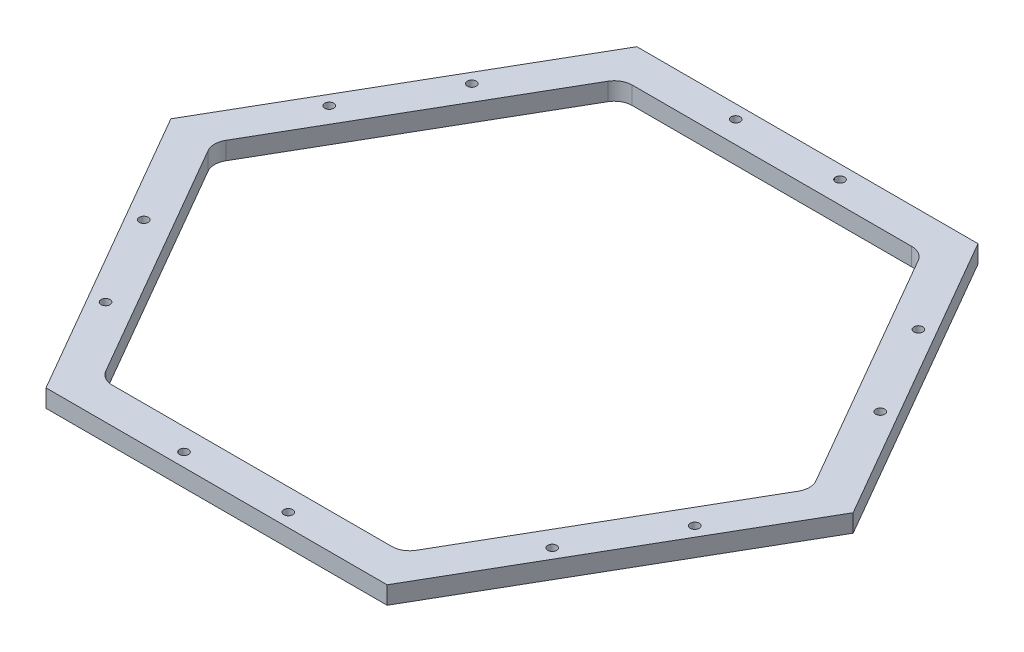
ISO-10303-21;
HEADER;
FILE_DESCRIPTION(('STEP AP214'),'2;1');
FILE_NAME('part.step','',(''),(''),'','','');
FILE_SCHEMA(('AUTOMOTIVE_DESIGN { 1 0 10303 214 1 1 1 1 }'));
ENDSEC;
DATA;
#1=APPLICATION_CONTEXT('core data for automotive mechanical design processes');
#2=APPLICATION_PROTOCOL_DEFINITION('international standard','automotive_design',2000,#1);
#3=PRODUCT_CONTEXT('',#1,'mechanical');
#4=PRODUCT('Part','Part','',(#3));
#5=PRODUCT_RELATED_PRODUCT_CATEGORY('part','',(#4));
#6=PRODUCT_DEFINITION_FORMATION('','',#4);
#7=PRODUCT_DEFINITION_CONTEXT('part definition',#1,'design');
#8=PRODUCT_DEFINITION('design','',#6,#7);
#9=PRODUCT_DEFINITION_SHAPE('','',#8);
#10=(LENGTH_UNIT() NAMED_UNIT(*) SI_UNIT(.MILLI.,.METRE.));
#11=(NAMED_UNIT(*) PLANE_ANGLE_UNIT() SI_UNIT($,.RADIAN.));
#12=(NAMED_UNIT(*) SI_UNIT($,.STERADIAN.) SOLID_ANGLE_UNIT());
#13=UNCERTAINTY_MEASURE_WITH_UNIT(LENGTH_MEASURE(1.E-05),#10,'distance_accuracy_value','');
#14=(GEOMETRIC_REPRESENTATION_CONTEXT(3) GLOBAL_UNCERTAINTY_ASSIGNED_CONTEXT((#13)) GLOBAL_UNIT_ASSIGNED_CONTEXT((#10,
#11,#12)) REPRESENTATION_CONTEXT('',''));
#15=CARTESIAN_POINT('',(0.,0.,0.));
#16=DIRECTION('',(0.,0.,1.));
#17=DIRECTION('',(1.,0.,0.));
#18=AXIS2_PLACEMENT_3D('',#15,#16,#17);
#19=CARTESIAN_POINT('',(0.,3.175,0.));
#20=DIRECTION('',(0.,1.,0.));
#21=DIRECTION('',(0.,0.,1.));
#22=AXIS2_PLACEMENT_3D('',#19,#20,#21);
#23=PLANE('',#22);
#24=CARTESIAN_POINT('',(47.7785158759953,3.175,-18.0656528205675));
#25=DIRECTION('',(0.,1.,0.));
#26=DIRECTION('',(0.,0.,1.));
#27=AXIS2_PLACEMENT_3D('',#24,#25,#26);
#28=CIRCLE('',#27,0.799999999999988);
#29=CARTESIAN_POINT('',(47.7785158759953,3.175,-17.2656528205675));
#30=VERTEX_POINT('',#29);
#31=EDGE_CURVE('E348',#30,#30,#28,.T.);
#32=ORIENTED_EDGE('',*,*,#31,.F.);
#33=EDGE_LOOP('',(#32));
#34=FACE_BOUND('',#33,.T.);
#35=CARTESIAN_POINT('',(38.4471631671902,3.175,-34.2280298155628));
#36=DIRECTION('',(0.,1.,0.));
#37=DIRECTION('',(0.,0.,1.));
#38=AXIS2_PLACEMENT_3D('',#35,#36,#37);
#39=CIRCLE('',#38,0.799999999999988);
#40=CARTESIAN_POINT('',(38.4471631671902,3.175,-33.4280298155628));
#41=VERTEX_POINT('',#40);
#42=EDGE_CURVE('E338',#41,#41,#39,.T.);
#43=ORIENTED_EDGE('',*,*,#42,.F.);
#44=EDGE_LOOP('',(#43));
#45=FACE_BOUND('',#44,.T.);
#46=CARTESIAN_POINT('',(39.534572216559,3.175,32.3445820934464));
#47=DIRECTION('',(0.,1.,0.));
#48=DIRECTION('',(0.,0.,1.));
#49=AXIS2_PLACEMENT_3D('',#46,#47,#48);
#50=CIRCLE('',#49,0.799999999999988);
#51=CARTESIAN_POINT('',(39.534572216559,3.175,33.1445820934464));
#52=VERTEX_POINT('',#51);
#53=EDGE_CURVE('E335',#52,#52,#50,.T.);
#54=ORIENTED_EDGE('',*,*,#53,.F.);
#55=EDGE_LOOP('',(#54));
#56=FACE_BOUND('',#55,.T.);
#57=CARTESIAN_POINT('',(48.8659249253636,3.175,16.1822050984508));
#58=DIRECTION('',(0.,1.,0.));
#59=DIRECTION('',(0.,0.,1.));
#60=AXIS2_PLACEMENT_3D('',#57,#58,#59);
#61=CIRCLE('',#60,0.799999999999988);
#62=CARTESIAN_POINT('',(48.8659249253636,3.175,16.9822050984508));
#63=VERTEX_POINT('',#62);
#64=EDGE_CURVE('E332',#63,#63,#61,.T.);
#65=ORIENTED_EDGE('',*,*,#64,.F.);
#66=EDGE_LOOP('',(#65));
#67=FACE_BOUND('',#66,.T.);
#68=CARTESIAN_POINT('',(-8.24394365943684,3.175,50.4102349140137));
#69=DIRECTION('',(0.,1.,0.));
#70=DIRECTION('',(0.,0.,1.));
#71=AXIS2_PLACEMENT_3D('',#68,#69,#70);
#72=CIRCLE('',#71,0.79999999999999);
#73=CARTESIAN_POINT('',(-8.24394365943684,3.175,51.2102349140137));
#74=VERTEX_POINT('',#73);
#75=EDGE_CURVE('E328',#74,#74,#72,.T.);
#76=ORIENTED_EDGE('',*,*,#75,.F.);
#77=EDGE_LOOP('',(#76));
#78=FACE_BOUND('',#77,.T.);
#79=CARTESIAN_POINT('',(10.4187617581729,3.175,50.4102349140136));
#80=DIRECTION('',(0.,1.,0.));
#81=DIRECTION('',(0.,0.,1.));
#82=AXIS2_PLACEMENT_3D('',#79,#80,#81);
#83=CIRCLE('',#82,0.79999999999999);
#84=CARTESIAN_POINT('',(10.4187617581729,3.175,51.2102349140136));
#85=VERTEX_POINT('',#84);
#86=EDGE_CURVE('E324',#85,#85,#83,.T.);
#87=ORIENTED_EDGE('',*,*,#86,.F.);
#88=EDGE_LOOP('',(#87));
#89=FACE_BOUND('',#88,.T.);
#90=CARTESIAN_POINT('',(-47.7785158759955,3.175,18.0656528205671));
#91=DIRECTION('',(0.,1.,0.));
#92=DIRECTION('',(0.,0.,1.));
#93=AXIS2_PLACEMENT_3D('',#90,#91,#92);
#94=CIRCLE('',#93,0.799999999999988);
#95=CARTESIAN_POINT('',(-47.7785158759955,3.175,18.8656528205671));
#96=VERTEX_POINT('',#95);
#97=EDGE_CURVE('E320',#96,#96,#94,.T.);
#98=ORIENTED_EDGE('',*,*,#97,.F.);
#99=EDGE_LOOP('',(#98));
#100=FACE_BOUND('',#99,.T.);
#101=CARTESIAN_POINT('',(-38.4471631671904,3.175,34.2280298155625));
#102=DIRECTION('',(0.,1.,0.));
#103=DIRECTION('',(0.,0.,1.));
#104=AXIS2_PLACEMENT_3D('',#101,#102,#103);
#105=CIRCLE('',#104,0.799999999999988);
#106=CARTESIAN_POINT('',(-38.4471631671904,3.175,35.0280298155625));
#107=VERTEX_POINT('',#106);
#108=EDGE_CURVE('E316',#107,#107,#105,.T.);
#109=ORIENTED_EDGE('',*,*,#108,.F.);
#110=EDGE_LOOP('',(#109));
#111=FACE_BOUND('',#110,.T.);
#112=CARTESIAN_POINT('',(-39.5345722165588,3.175,-32.3445820934467));
#113=DIRECTION('',(0.,1.,0.));
#114=DIRECTION('',(0.,0.,1.));
#115=AXIS2_PLACEMENT_3D('',#112,#113,#114);
#116=CIRCLE('',#115,0.799999999999988);
#117=CARTESIAN_POINT('',(-39.5345722165588,3.175,-31.5445820934467));
#118=VERTEX_POINT('',#117);
#119=EDGE_CURVE('E312',#118,#118,#116,.T.);
#120=ORIENTED_EDGE('',*,*,#119,.F.);
#121=EDGE_LOOP('',(#120));
#122=FACE_BOUND('',#121,.T.);
#123=CARTESIAN_POINT('',(-48.8659249253635,3.175,-16.1822050984511));
#124=DIRECTION('',(0.,1.,0.));
#125=DIRECTION('',(0.,0.,1.));
#126=AXIS2_PLACEMENT_3D('',#123,#124,#125);
#127=CIRCLE('',#126,0.799999999999988);
#128=CARTESIAN_POINT('',(-48.8659249253635,3.175,-15.3822050984511));
#129=VERTEX_POINT('',#128);
#130=EDGE_CURVE('E308',#129,#129,#127,.T.);
#131=ORIENTED_EDGE('',*,*,#130,.F.);
#132=EDGE_LOOP('',(#131));
#133=FACE_BOUND('',#132,.T.);
#134=CARTESIAN_POINT('',(8.24394365943684,3.175,-50.4102349140137));
#135=DIRECTION('',(0.,1.,0.));
#136=DIRECTION('',(0.,0.,1.));
#137=AXIS2_PLACEMENT_3D('',#134,#135,#136);
#138=CIRCLE('',#137,0.79999999999999);
#139=CARTESIAN_POINT('',(8.24394365943684,3.175,-49.6102349140137));
#140=VERTEX_POINT('',#139);
#141=EDGE_CURVE('E304',#140,#140,#138,.T.);
#142=ORIENTED_EDGE('',*,*,#141,.F.);
#143=EDGE_LOOP('',(#142));
#144=FACE_BOUND('',#143,.T.);
#145=CARTESIAN_POINT('',(-10.4187617581729,3.175,-50.4102349140136));
#146=DIRECTION('',(0.,1.,0.));
#147=DIRECTION('',(0.,0.,1.));
#148=AXIS2_PLACEMENT_3D('',#145,#146,#147);
#149=CIRCLE('',#148,0.79999999999999);
#150=CARTESIAN_POINT('',(-10.4187617581729,3.175,-49.6102349140136));
#151=VERTEX_POINT('',#150);
#152=EDGE_CURVE('E300',#151,#151,#149,.T.);
#153=ORIENTED_EDGE('',*,*,#152,.F.);
#154=EDGE_LOOP('',(#153));
#155=FACE_BOUND('',#154,.T.);
#156=DIRECTION('',(0.5,0.,-0.866025403784438));
#157=VECTOR('',#156,1.);
#158=CARTESIAN_POINT('',(30.4992613140312,3.175,52.8262701892219));
#159=LINE('',#158,#157);
#160=CARTESIAN_POINT('',(30.4992613140312,3.175,52.8262701892219));
#161=VERTEX_POINT('',#160);
#162=CARTESIAN_POINT('',(60.9985226280624,3.175,0.));
#163=VERTEX_POINT('',#162);
#164=EDGE_CURVE('E259',#161,#163,#159,.T.);
#165=ORIENTED_EDGE('',*,*,#164,.T.);
#166=DIRECTION('',(-0.5,0.,-0.866025403784439));
#167=VECTOR('',#166,1.);
#168=CARTESIAN_POINT('',(60.9985226280624,3.175,0.));
#169=LINE('',#168,#167);
#170=CARTESIAN_POINT('',(30.4992613140312,3.175,-52.8262701892219));
#171=VERTEX_POINT('',#170);
#172=EDGE_CURVE('E262',#163,#171,#169,.T.);
#173=ORIENTED_EDGE('',*,*,#172,.T.);
#174=DIRECTION('',(-1.,0.,0.));
#175=VECTOR('',#174,1.);
#176=CARTESIAN_POINT('',(30.4992613140312,3.175,-52.8262701892219));
#177=LINE('',#176,#175);
#178=CARTESIAN_POINT('',(-30.4992613140312,3.175,-52.8262701892219));
#179=VERTEX_POINT('',#178);
#180=EDGE_CURVE('E265',#171,#179,#177,.T.);
#181=ORIENTED_EDGE('',*,*,#180,.T.);
#182=DIRECTION('',(-0.5,0.,0.866025403784439));
#183=VECTOR('',#182,1.);
#184=CARTESIAN_POINT('',(-30.4992613140312,3.175,-52.8262701892219));
#185=LINE('',#184,#183);
#186=CARTESIAN_POINT('',(-60.9985226280624,3.175,0.));
#187=VERTEX_POINT('',#186);
#188=EDGE_CURVE('E267',#179,#187,#185,.T.);
#189=ORIENTED_EDGE('',*,*,#188,.T.);
#190=DIRECTION('',(0.5,0.,0.866025403784438));
#191=VECTOR('',#190,1.);
#192=CARTESIAN_POINT('',(-60.9985226280624,3.175,0.));
#193=LINE('',#192,#191);
#194=CARTESIAN_POINT('',(-30.4992613140312,3.175,52.8262701892219));
#195=VERTEX_POINT('',#194);
#196=EDGE_CURVE('E269',#187,#195,#193,.T.);
#197=ORIENTED_EDGE('',*,*,#196,.T.);
#198=DIRECTION('',(1.,0.,0.));
#199=VECTOR('',#198,1.);
#200=CARTESIAN_POINT('',(-30.4992613140312,3.175,52.8262701892219));
#201=LINE('',#200,#199);
#202=EDGE_CURVE('E271',#195,#161,#201,.T.);
#203=ORIENTED_EDGE('',*,*,#202,.T.);
#204=EDGE_LOOP('',(#165,#173,#181,#189,#197,#203));
#205=FACE_BOUND('',#204,.T.);
#206=DIRECTION('',(0.5,0.,0.866025403784438));
#207=VECTOR('',#206,1.);
#208=CARTESIAN_POINT('',(-52.7496306570156,3.175,1.58750000000003));
#209=LINE('',#208,#207);
#210=CARTESIAN_POINT('',(-52.7496306570156,3.175,1.58750000000003));
#211=VERTEX_POINT('',#210);
#212=CARTESIAN_POINT('',(-27.7496306570156,3.175,44.8887701892219));
#213=VERTEX_POINT('',#212);
#214=EDGE_CURVE('E172',#211,#213,#209,.T.);
#215=ORIENTED_EDGE('',*,*,#214,.F.);
#216=CARTESIAN_POINT('',(-50.,3.175,0.));
#217=DIRECTION('',(0.,1.,0.));
#218=DIRECTION('',(0.,0.,1.));
#219=AXIS2_PLACEMENT_3D('',#216,#217,#218);
#220=CIRCLE('',#219,3.17500000000001);
#221=CARTESIAN_POINT('',(-52.7496306570156,3.175,-1.58749999999998));
#222=VERTEX_POINT('',#221);
#223=EDGE_CURVE('E164',#222,#211,#220,.T.);
#224=ORIENTED_EDGE('',*,*,#223,.F.);
#225=DIRECTION('',(-0.5,0.,0.866025403784439));
#226=VECTOR('',#225,1.);
#227=CARTESIAN_POINT('',(-27.7496306570156,3.175,-44.8887701892219));
#228=LINE('',#227,#226);
#229=CARTESIAN_POINT('',(-27.7496306570156,3.175,-44.8887701892219));
#230=VERTEX_POINT('',#229);
#231=EDGE_CURVE('E206',#230,#222,#228,.T.);
#232=ORIENTED_EDGE('',*,*,#231,.F.);
#233=CARTESIAN_POINT('',(-25.,3.175,-43.3012701892219));
#234=DIRECTION('',(0.,1.,0.));
#235=DIRECTION('',(0.,0.,1.));
#236=AXIS2_PLACEMENT_3D('',#233,#234,#235);
#237=CIRCLE('',#236,3.175);
#238=CARTESIAN_POINT('',(-25.,3.175,-46.4762701892219));
#239=VERTEX_POINT('',#238);
#240=EDGE_CURVE('E204',#239,#230,#237,.T.);
#241=ORIENTED_EDGE('',*,*,#240,.F.);
#242=DIRECTION('',(-1.,0.,0.));
#243=VECTOR('',#242,1.);
#244=CARTESIAN_POINT('',(25.,3.175,-46.4762701892219));
#245=LINE('',#244,#243);
#246=CARTESIAN_POINT('',(25.,3.175,-46.4762701892219));
#247=VERTEX_POINT('',#246);
#248=EDGE_CURVE('E202',#247,#239,#245,.T.);
#249=ORIENTED_EDGE('',*,*,#248,.F.);
#250=CARTESIAN_POINT('',(25.,3.175,-43.3012701892219));
#251=DIRECTION('',(0.,1.,0.));
#252=DIRECTION('',(0.,0.,1.));
#253=AXIS2_PLACEMENT_3D('',#250,#251,#252);
#254=CIRCLE('',#253,3.175);
#255=CARTESIAN_POINT('',(27.7496306570156,3.175,-44.8887701892219));
#256=VERTEX_POINT('',#255);
#257=EDGE_CURVE('E200',#256,#247,#254,.T.);
#258=ORIENTED_EDGE('',*,*,#257,.F.);
#259=DIRECTION('',(-0.5,0.,-0.866025403784439));
#260=VECTOR('',#259,1.);
#261=CARTESIAN_POINT('',(52.7496306570156,3.175,-1.58750000000003));
#262=LINE('',#261,#260);
#263=CARTESIAN_POINT('',(52.7496306570156,3.175,-1.58750000000003));
#264=VERTEX_POINT('',#263);
#265=EDGE_CURVE('E198',#264,#256,#262,.T.);
#266=ORIENTED_EDGE('',*,*,#265,.F.);
#267=CARTESIAN_POINT('',(50.,3.175,0.));
#268=DIRECTION('',(0.,1.,0.));
#269=DIRECTION('',(0.,0.,-1.));
#270=AXIS2_PLACEMENT_3D('',#267,#268,#269);
#271=CIRCLE('',#270,3.175);
#272=CARTESIAN_POINT('',(52.7496306570156,3.175,1.58749999999997));
#273=VERTEX_POINT('',#272);
#274=EDGE_CURVE('E196',#273,#264,#271,.T.);
#275=ORIENTED_EDGE('',*,*,#274,.F.);
#276=DIRECTION('',(0.5,0.,-0.866025403784439));
#277=VECTOR('',#276,1.);
#278=CARTESIAN_POINT('',(27.7496306570156,3.175,44.8887701892219));
#279=LINE('',#278,#277);
#280=CARTESIAN_POINT('',(27.7496306570156,3.175,44.8887701892219));
#281=VERTEX_POINT('',#280);
#282=EDGE_CURVE('E194',#281,#273,#279,.T.);
#283=ORIENTED_EDGE('',*,*,#282,.F.);
#284=CARTESIAN_POINT('',(25.,3.175,43.3012701892219));
#285=DIRECTION('',(0.,1.,0.));
#286=DIRECTION('',(0.,0.,1.));
#287=AXIS2_PLACEMENT_3D('',#284,#285,#286);
#288=CIRCLE('',#287,3.175);
#289=CARTESIAN_POINT('',(25.,3.175,46.4762701892219));
#290=VERTEX_POINT('',#289);
#291=EDGE_CURVE('E192',#290,#281,#288,.T.);
#292=ORIENTED_EDGE('',*,*,#291,.F.);
#293=DIRECTION('',(1.,0.,0.));
#294=VECTOR('',#293,1.);
#295=CARTESIAN_POINT('',(-25.,3.175,46.4762701892219));
#296=LINE('',#295,#294);
#297=CARTESIAN_POINT('',(-25.,3.175,46.4762701892219));
#298=VERTEX_POINT('',#297);
#299=EDGE_CURVE('E187',#298,#290,#296,.T.);
#300=ORIENTED_EDGE('',*,*,#299,.F.);
#301=CARTESIAN_POINT('',(-25.,3.175,43.3012701892219));
#302=DIRECTION('',(0.,1.,0.));
#303=DIRECTION('',(0.,0.,1.));
#304=AXIS2_PLACEMENT_3D('',#301,#302,#303);
#305=CIRCLE('',#304,3.175);
#306=EDGE_CURVE('E185',#213,#298,#305,.T.);
#307=ORIENTED_EDGE('',*,*,#306,.F.);
#308=EDGE_LOOP('',(#215,#224,#232,#241,#249,#258,#266,#275,#283,#292,#300,#307));
#309=FACE_BOUND('',#308,.T.);
#310=ADVANCED_FACE('F37',(#34,#45,#56,#67,#78,#89,#100,#111,#122,#133,#144,#155,#205,#309),#23,.T.);
#311=CARTESIAN_POINT('',(0.,0.,0.));
#312=DIRECTION('',(0.,1.,0.));
#313=DIRECTION('',(0.,0.,1.));
#314=AXIS2_PLACEMENT_3D('',#311,#312,#313);
#315=PLANE('',#314);
#316=CARTESIAN_POINT('',(47.7785158759953,0.,-18.0656528205675));
#317=DIRECTION('',(0.,1.,0.));
#318=DIRECTION('',(0.,0.,1.));
#319=AXIS2_PLACEMENT_3D('',#316,#317,#318);
#320=CIRCLE('',#319,0.799999999999988);
#321=CARTESIAN_POINT('',(47.7785158759953,0.,-17.2656528205675));
#322=VERTEX_POINT('',#321);
#323=EDGE_CURVE('E41',#322,#322,#320,.T.);
#324=ORIENTED_EDGE('',*,*,#323,.T.);
#325=EDGE_LOOP('',(#324));
#326=FACE_BOUND('',#325,.T.);
#327=CARTESIAN_POINT('',(38.4471631671902,0.,-34.2280298155628));
#328=DIRECTION('',(0.,1.,0.));
#329=DIRECTION('',(0.,0.,1.));
#330=AXIS2_PLACEMENT_3D('',#327,#328,#329);
#331=CIRCLE('',#330,0.799999999999988);
#332=CARTESIAN_POINT('',(38.4471631671902,0.,-33.4280298155628));
#333=VERTEX_POINT('',#332);
#334=EDGE_CURVE('E336',#333,#333,#331,.T.);
#335=ORIENTED_EDGE('',*,*,#334,.T.);
#336=EDGE_LOOP('',(#335));
#337=FACE_BOUND('',#336,.T.);
#338=CARTESIAN_POINT('',(39.534572216559,0.,32.3445820934464));
#339=DIRECTION('',(0.,1.,0.));
#340=DIRECTION('',(0.,0.,1.));
#341=AXIS2_PLACEMENT_3D('',#338,#339,#340);
#342=CIRCLE('',#341,0.799999999999988);
#343=CARTESIAN_POINT('',(39.534572216559,0.,33.1445820934464));
#344=VERTEX_POINT('',#343);
#345=EDGE_CURVE('E333',#344,#344,#342,.T.);
#346=ORIENTED_EDGE('',*,*,#345,.T.);
#347=EDGE_LOOP('',(#346));
#348=FACE_BOUND('',#347,.T.);
#349=CARTESIAN_POINT('',(48.8659249253636,0.,16.1822050984508));
#350=DIRECTION('',(0.,1.,0.));
#351=DIRECTION('',(0.,0.,1.));
#352=AXIS2_PLACEMENT_3D('',#349,#350,#351);
#353=CIRCLE('',#352,0.799999999999988);
#354=CARTESIAN_POINT('',(48.8659249253636,0.,16.9822050984508));
#355=VERTEX_POINT('',#354);
#356=EDGE_CURVE('E329',#355,#355,#353,.T.);
#357=ORIENTED_EDGE('',*,*,#356,.T.);
#358=EDGE_LOOP('',(#357));
#359=FACE_BOUND('',#358,.T.);
#360=CARTESIAN_POINT('',(-8.24394365943684,0.,50.4102349140137));
#361=DIRECTION('',(0.,1.,0.));
#362=DIRECTION('',(0.,0.,1.));
#363=AXIS2_PLACEMENT_3D('',#360,#361,#362);
#364=CIRCLE('',#363,0.799999999999989);
#365=CARTESIAN_POINT('',(-8.24394365943684,0.,51.2102349140137));
#366=VERTEX_POINT('',#365);
#367=EDGE_CURVE('E325',#366,#366,#364,.T.);
#368=ORIENTED_EDGE('',*,*,#367,.T.);
#369=EDGE_LOOP('',(#368));
#370=FACE_BOUND('',#369,.T.);
#371=CARTESIAN_POINT('',(10.4187617581729,0.,50.4102349140136));
#372=DIRECTION('',(0.,1.,0.));
#373=DIRECTION('',(0.,0.,1.));
#374=AXIS2_PLACEMENT_3D('',#371,#372,#373);
#375=CIRCLE('',#374,0.799999999999989);
#376=CARTESIAN_POINT('',(10.4187617581729,0.,51.2102349140136));
#377=VERTEX_POINT('',#376);
#378=EDGE_CURVE('E321',#377,#377,#375,.T.);
#379=ORIENTED_EDGE('',*,*,#378,.T.);
#380=EDGE_LOOP('',(#379));
#381=FACE_BOUND('',#380,.T.);
#382=CARTESIAN_POINT('',(-47.7785158759955,0.,18.0656528205671));
#383=DIRECTION('',(0.,1.,0.));
#384=DIRECTION('',(0.,0.,1.));
#385=AXIS2_PLACEMENT_3D('',#382,#383,#384);
#386=CIRCLE('',#385,0.799999999999988);
#387=CARTESIAN_POINT('',(-47.7785158759955,0.,18.8656528205671));
#388=VERTEX_POINT('',#387);
#389=EDGE_CURVE('E317',#388,#388,#386,.T.);
#390=ORIENTED_EDGE('',*,*,#389,.T.);
#391=EDGE_LOOP('',(#390));
#392=FACE_BOUND('',#391,.T.);
#393=CARTESIAN_POINT('',(-38.4471631671904,0.,34.2280298155625));
#394=DIRECTION('',(0.,1.,0.));
#395=DIRECTION('',(0.,0.,1.));
#396=AXIS2_PLACEMENT_3D('',#393,#394,#395);
#397=CIRCLE('',#396,0.799999999999988);
#398=CARTESIAN_POINT('',(-38.4471631671904,0.,35.0280298155625));
#399=VERTEX_POINT('',#398);
#400=EDGE_CURVE('E313',#399,#399,#397,.T.);
#401=ORIENTED_EDGE('',*,*,#400,.T.);
#402=EDGE_LOOP('',(#401));
#403=FACE_BOUND('',#402,.T.);
#404=CARTESIAN_POINT('',(-39.5345722165588,0.,-32.3445820934467));
#405=DIRECTION('',(0.,1.,0.));
#406=DIRECTION('',(0.,0.,1.));
#407=AXIS2_PLACEMENT_3D('',#404,#405,#406);
#408=CIRCLE('',#407,0.799999999999988);
#409=CARTESIAN_POINT('',(-39.5345722165588,0.,-31.5445820934467));
#410=VERTEX_POINT('',#409);
#411=EDGE_CURVE('E309',#410,#410,#408,.T.);
#412=ORIENTED_EDGE('',*,*,#411,.T.);
#413=EDGE_LOOP('',(#412));
#414=FACE_BOUND('',#413,.T.);
#415=CARTESIAN_POINT('',(-48.8659249253635,0.,-16.1822050984511));
#416=DIRECTION('',(0.,1.,0.));
#417=DIRECTION('',(0.,0.,1.));
#418=AXIS2_PLACEMENT_3D('',#415,#416,#417);
#419=CIRCLE('',#418,0.799999999999988);
#420=CARTESIAN_POINT('',(-48.8659249253635,0.,-15.3822050984511));
#421=VERTEX_POINT('',#420);
#422=EDGE_CURVE('E305',#421,#421,#419,.T.);
#423=ORIENTED_EDGE('',*,*,#422,.T.);
#424=EDGE_LOOP('',(#423));
#425=FACE_BOUND('',#424,.T.);
#426=CARTESIAN_POINT('',(8.24394365943684,0.,-50.4102349140137));
#427=DIRECTION('',(0.,1.,0.));
#428=DIRECTION('',(0.,0.,1.));
#429=AXIS2_PLACEMENT_3D('',#426,#427,#428);
#430=CIRCLE('',#429,0.799999999999989);
#431=CARTESIAN_POINT('',(8.24394365943684,0.,-49.6102349140137));
#432=VERTEX_POINT('',#431);
#433=EDGE_CURVE('E301',#432,#432,#430,.T.);
#434=ORIENTED_EDGE('',*,*,#433,.T.);
#435=EDGE_LOOP('',(#434));
#436=FACE_BOUND('',#435,.T.);
#437=CARTESIAN_POINT('',(-10.4187617581729,0.,-50.4102349140136));
#438=DIRECTION('',(0.,1.,0.));
#439=DIRECTION('',(0.,0.,1.));
#440=AXIS2_PLACEMENT_3D('',#437,#438,#439);
#441=CIRCLE('',#440,0.799999999999989);
#442=CARTESIAN_POINT('',(-10.4187617581729,0.,-49.6102349140136));
#443=VERTEX_POINT('',#442);
#444=EDGE_CURVE('E209',#443,#443,#441,.T.);
#445=ORIENTED_EDGE('',*,*,#444,.T.);
#446=EDGE_LOOP('',(#445));
#447=FACE_BOUND('',#446,.T.);
#448=DIRECTION('',(0.5,0.,-0.866025403784438));
#449=VECTOR('',#448,1.);
#450=CARTESIAN_POINT('',(30.4992613140312,0.,52.8262701892219));
#451=LINE('',#450,#449);
#452=CARTESIAN_POINT('',(30.4992613140312,0.,52.8262701892219));
#453=VERTEX_POINT('',#452);
#454=CARTESIAN_POINT('',(60.9985226280624,0.,0.));
#455=VERTEX_POINT('',#454);
#456=EDGE_CURVE('E180',#453,#455,#451,.T.);
#457=ORIENTED_EDGE('',*,*,#456,.F.);
#458=DIRECTION('',(1.,0.,0.));
#459=VECTOR('',#458,1.);
#460=CARTESIAN_POINT('',(-30.4992613140312,0.,52.8262701892219));
#461=LINE('',#460,#459);
#462=CARTESIAN_POINT('',(-30.4992613140312,0.,52.8262701892219));
#463=VERTEX_POINT('',#462);
#464=EDGE_CURVE('E263',#463,#453,#461,.T.);
#465=ORIENTED_EDGE('',*,*,#464,.F.);
#466=DIRECTION('',(0.5,0.,0.866025403784438));
#467=VECTOR('',#466,1.);
#468=CARTESIAN_POINT('',(-60.9985226280624,0.,0.));
#469=LINE('',#468,#467);
#470=CARTESIAN_POINT('',(-60.9985226280624,0.,0.));
#471=VERTEX_POINT('',#470);
#472=EDGE_CURVE('E282',#471,#463,#469,.T.);
#473=ORIENTED_EDGE('',*,*,#472,.F.);
#474=DIRECTION('',(-0.5,0.,0.866025403784439));
#475=VECTOR('',#474,1.);
#476=CARTESIAN_POINT('',(-30.4992613140312,0.,-52.8262701892219));
#477=LINE('',#476,#475);
#478=CARTESIAN_POINT('',(-30.4992613140312,0.,-52.8262701892219));
#479=VERTEX_POINT('',#478);
#480=EDGE_CURVE('E280',#479,#471,#477,.T.);
#481=ORIENTED_EDGE('',*,*,#480,.F.);
#482=DIRECTION('',(-1.,0.,0.));
#483=VECTOR('',#482,1.);
#484=CARTESIAN_POINT('',(30.4992613140312,0.,-52.8262701892219));
#485=LINE('',#484,#483);
#486=CARTESIAN_POINT('',(30.4992613140312,0.,-52.8262701892219));
#487=VERTEX_POINT('',#486);
#488=EDGE_CURVE('E278',#487,#479,#485,.T.);
#489=ORIENTED_EDGE('',*,*,#488,.F.);
#490=DIRECTION('',(-0.5,0.,-0.866025403784439));
#491=VECTOR('',#490,1.);
#492=CARTESIAN_POINT('',(60.9985226280624,0.,0.));
#493=LINE('',#492,#491);
#494=EDGE_CURVE('E276',#455,#487,#493,.T.);
#495=ORIENTED_EDGE('',*,*,#494,.F.);
#496=EDGE_LOOP('',(#457,#465,#473,#481,#489,#495));
#497=FACE_BOUND('',#496,.T.);
#498=CARTESIAN_POINT('',(-50.,0.,0.));
#499=DIRECTION('',(0.,1.,0.));
#500=DIRECTION('',(0.,0.,1.));
#501=AXIS2_PLACEMENT_3D('',#498,#499,#500);
#502=CIRCLE('',#501,3.17500000000001);
#503=CARTESIAN_POINT('',(-52.7496306570156,0.,-1.58749999999998));
#504=VERTEX_POINT('',#503);
#505=CARTESIAN_POINT('',(-52.7496306570156,0.,1.58750000000003));
#506=VERTEX_POINT('',#505);
#507=EDGE_CURVE('E62',#504,#506,#502,.T.);
#508=ORIENTED_EDGE('',*,*,#507,.T.);
#509=DIRECTION('',(0.5,0.,0.866025403784438));
#510=VECTOR('',#509,1.);
#511=CARTESIAN_POINT('',(-52.7496306570156,0.,1.58750000000003));
#512=LINE('',#511,#510);
#513=CARTESIAN_POINT('',(-27.7496306570156,0.,44.8887701892219));
#514=VERTEX_POINT('',#513);
#515=EDGE_CURVE('E179',#506,#514,#512,.T.);
#516=ORIENTED_EDGE('',*,*,#515,.T.);
#517=CARTESIAN_POINT('',(-25.,0.,43.3012701892219));
#518=DIRECTION('',(0.,1.,0.));
#519=DIRECTION('',(0.,0.,1.));
#520=AXIS2_PLACEMENT_3D('',#517,#518,#519);
#521=CIRCLE('',#520,3.175);
#522=CARTESIAN_POINT('',(-25.,0.,46.4762701892219));
#523=VERTEX_POINT('',#522);
#524=EDGE_CURVE('E211',#514,#523,#521,.T.);
#525=ORIENTED_EDGE('',*,*,#524,.T.);
#526=DIRECTION('',(1.,0.,0.));
#527=VECTOR('',#526,1.);
#528=CARTESIAN_POINT('',(-25.,0.,46.4762701892219));
#529=LINE('',#528,#527);
#530=CARTESIAN_POINT('',(25.,0.,46.4762701892219));
#531=VERTEX_POINT('',#530);
#532=EDGE_CURVE('E214',#523,#531,#529,.T.);
#533=ORIENTED_EDGE('',*,*,#532,.T.);
#534=CARTESIAN_POINT('',(25.,0.,43.3012701892219));
#535=DIRECTION('',(0.,1.,0.));
#536=DIRECTION('',(0.,0.,1.));
#537=AXIS2_PLACEMENT_3D('',#534,#535,#536);
#538=CIRCLE('',#537,3.175);
#539=CARTESIAN_POINT('',(27.7496306570156,0.,44.8887701892219));
#540=VERTEX_POINT('',#539);
#541=EDGE_CURVE('E217',#531,#540,#538,.T.);
#542=ORIENTED_EDGE('',*,*,#541,.T.);
#543=DIRECTION('',(0.5,0.,-0.866025403784439));
#544=VECTOR('',#543,1.);
#545=CARTESIAN_POINT('',(27.7496306570156,0.,44.8887701892219));
#546=LINE('',#545,#544);
#547=CARTESIAN_POINT('',(52.7496306570156,0.,1.58749999999997));
#548=VERTEX_POINT('',#547);
#549=EDGE_CURVE('E220',#540,#548,#546,.T.);
#550=ORIENTED_EDGE('',*,*,#549,.T.);
#551=CARTESIAN_POINT('',(50.,0.,0.));
#552=DIRECTION('',(0.,1.,0.));
#553=DIRECTION('',(0.,0.,-1.));
#554=AXIS2_PLACEMENT_3D('',#551,#552,#553);
#555=CIRCLE('',#554,3.175);
#556=CARTESIAN_POINT('',(52.7496306570156,0.,-1.58750000000003));
#557=VERTEX_POINT('',#556);
#558=EDGE_CURVE('E223',#548,#557,#555,.T.);
#559=ORIENTED_EDGE('',*,*,#558,.T.);
#560=DIRECTION('',(-0.5,0.,-0.866025403784439));
#561=VECTOR('',#560,1.);
#562=CARTESIAN_POINT('',(52.7496306570156,0.,-1.58750000000003));
#563=LINE('',#562,#561);
#564=CARTESIAN_POINT('',(27.7496306570156,0.,-44.8887701892219));
#565=VERTEX_POINT('',#564);
#566=EDGE_CURVE('E226',#557,#565,#563,.T.);
#567=ORIENTED_EDGE('',*,*,#566,.T.);
#568=CARTESIAN_POINT('',(25.,0.,-43.3012701892219));
#569=DIRECTION('',(0.,1.,0.));
#570=DIRECTION('',(0.,0.,1.));
#571=AXIS2_PLACEMENT_3D('',#568,#569,#570);
#572=CIRCLE('',#571,3.175);
#573=CARTESIAN_POINT('',(25.,0.,-46.4762701892219));
#574=VERTEX_POINT('',#573);
#575=EDGE_CURVE('E229',#565,#574,#572,.T.);
#576=ORIENTED_EDGE('',*,*,#575,.T.);
#577=DIRECTION('',(-1.,0.,0.));
#578=VECTOR('',#577,1.);
#579=CARTESIAN_POINT('',(25.,0.,-46.4762701892219));
#580=LINE('',#579,#578);
#581=CARTESIAN_POINT('',(-25.,0.,-46.4762701892219));
#582=VERTEX_POINT('',#581);
#583=EDGE_CURVE('E232',#574,#582,#580,.T.);
#584=ORIENTED_EDGE('',*,*,#583,.T.);
#585=CARTESIAN_POINT('',(-25.,0.,-43.3012701892219));
#586=DIRECTION('',(0.,1.,0.));
#587=DIRECTION('',(0.,0.,1.));
#588=AXIS2_PLACEMENT_3D('',#585,#586,#587);
#589=CIRCLE('',#588,3.175);
#590=CARTESIAN_POINT('',(-27.7496306570156,0.,-44.8887701892219));
#591=VERTEX_POINT('',#590);
#592=EDGE_CURVE('E235',#582,#591,#589,.T.);
#593=ORIENTED_EDGE('',*,*,#592,.T.);
#594=DIRECTION('',(-0.5,0.,0.866025403784439));
#595=VECTOR('',#594,1.);
#596=CARTESIAN_POINT('',(-27.7496306570156,0.,-44.8887701892219));
#597=LINE('',#596,#595);
#598=EDGE_CURVE('E173',#591,#504,#597,.T.);
#599=ORIENTED_EDGE('',*,*,#598,.T.);
#600=EDGE_LOOP('',(#508,#516,#525,#533,#542,#550,#559,#567,#576,#584,#593,#599));
#601=FACE_BOUND('',#600,.T.);
#602=ADVANCED_FACE('F374',(#326,#337,#348,#359,#370,#381,#392,#403,#414,#425,#436,#447,#497,
#601),#315,.F.);
#603=CARTESIAN_POINT('',(30.4992613140312,3.175,52.8262701892219));
#604=DIRECTION('',(-0.866025403784438,0.,-0.5));
#605=DIRECTION('',(-0.5,0.,0.866025403784439));
#606=AXIS2_PLACEMENT_3D('',#603,#604,#605);
#607=PLANE('',#606);
#608=ORIENTED_EDGE('',*,*,#456,.T.);
#609=DIRECTION('',(0.,-1.,0.));
#610=VECTOR('',#609,1.);
#611=CARTESIAN_POINT('',(60.9985226280624,3.175,0.));
#612=LINE('',#611,#610);
#613=EDGE_CURVE('E11',#163,#455,#612,.T.);
#614=ORIENTED_EDGE('',*,*,#613,.F.);
#615=ORIENTED_EDGE('',*,*,#164,.F.);
#616=DIRECTION('',(0.,-1.,0.));
#617=VECTOR('',#616,1.);
#618=CARTESIAN_POINT('',(30.4992613140312,3.175,52.8262701892219));
#619=LINE('',#618,#617);
#620=EDGE_CURVE('E273',#161,#453,#619,.T.);
#621=ORIENTED_EDGE('',*,*,#620,.T.);
#622=EDGE_LOOP('',(#608,#614,#615,#621));
#623=FACE_BOUND('',#622,.T.);
#624=ADVANCED_FACE('F39',(#623),#607,.F.);
#625=CARTESIAN_POINT('',(60.9985226280624,3.175,0.));
#626=DIRECTION('',(-0.866025403784438,0.,0.5));
#627=DIRECTION('',(0.5,0.,0.866025403784439));
#628=AXIS2_PLACEMENT_3D('',#625,#626,#627);
#629=PLANE('',#628);
#630=ORIENTED_EDGE('',*,*,#494,.T.);
#631=DIRECTION('',(0.,-1.,0.));
#632=VECTOR('',#631,1.);
#633=CARTESIAN_POINT('',(30.4992613140312,3.175,-52.8262701892219));
#634=LINE('',#633,#632);
#635=EDGE_CURVE('E46',#171,#487,#634,.T.);
#636=ORIENTED_EDGE('',*,*,#635,.F.);
#637=ORIENTED_EDGE('',*,*,#172,.F.);
#638=ORIENTED_EDGE('',*,*,#613,.T.);
#639=EDGE_LOOP('',(#630,#636,#637,#638));
#640=FACE_BOUND('',#639,.T.);
#641=ADVANCED_FACE('F385',(#640),#629,.F.);
#642=CARTESIAN_POINT('',(30.4992613140312,3.175,-52.8262701892219));
#643=DIRECTION('',(0.,0.,1.));
#644=DIRECTION('',(1.,0.,0.));
#645=AXIS2_PLACEMENT_3D('',#642,#643,#644);
#646=PLANE('',#645);
#647=ORIENTED_EDGE('',*,*,#488,.T.);
#648=DIRECTION('',(0.,-1.,0.));
#649=VECTOR('',#648,1.);
#650=CARTESIAN_POINT('',(-30.4992613140312,3.175,-52.8262701892219));
#651=LINE('',#650,#649);
#652=EDGE_CURVE('E293',#179,#479,#651,.T.);
#653=ORIENTED_EDGE('',*,*,#652,.F.);
#654=ORIENTED_EDGE('',*,*,#180,.F.);
#655=ORIENTED_EDGE('',*,*,#635,.T.);
#656=EDGE_LOOP('',(#647,#653,#654,#655));
#657=FACE_BOUND('',#656,.T.);
#658=ADVANCED_FACE('F390',(#657),#646,.F.);
#659=CARTESIAN_POINT('',(-30.4992613140312,3.175,-52.8262701892219));
#660=DIRECTION('',(0.866025403784439,0.,0.5));
#661=DIRECTION('',(0.5,0.,-0.866025403784439));
#662=AXIS2_PLACEMENT_3D('',#659,#660,#661);
#663=PLANE('',#662);
#664=ORIENTED_EDGE('',*,*,#480,.T.);
#665=DIRECTION('',(0.,-1.,0.));
#666=VECTOR('',#665,1.);
#667=CARTESIAN_POINT('',(-60.9985226280624,3.175,0.));
#668=LINE('',#667,#666);
#669=EDGE_CURVE('E290',#187,#471,#668,.T.);
#670=ORIENTED_EDGE('',*,*,#669,.F.);
#671=ORIENTED_EDGE('',*,*,#188,.F.);
#672=ORIENTED_EDGE('',*,*,#652,.T.);
#673=EDGE_LOOP('',(#664,#670,#671,#672));
#674=FACE_BOUND('',#673,.T.);
#675=ADVANCED_FACE('F396',(#674),#663,.F.);
#676=CARTESIAN_POINT('',(-60.9985226280624,3.175,0.));
#677=DIRECTION('',(0.866025403784438,0.,-0.5));
#678=DIRECTION('',(-0.5,0.,-0.866025403784439));
#679=AXIS2_PLACEMENT_3D('',#676,#677,#678);
#680=PLANE('',#679);
#681=ORIENTED_EDGE('',*,*,#472,.T.);
#682=DIRECTION('',(0.,-1.,0.));
#683=VECTOR('',#682,1.);
#684=CARTESIAN_POINT('',(-30.4992613140312,3.175,52.8262701892219));
#685=LINE('',#684,#683);
#686=EDGE_CURVE('E287',#195,#463,#685,.T.);
#687=ORIENTED_EDGE('',*,*,#686,.F.);
#688=ORIENTED_EDGE('',*,*,#196,.F.);
#689=ORIENTED_EDGE('',*,*,#669,.T.);
#690=EDGE_LOOP('',(#681,#687,#688,#689));
#691=FACE_BOUND('',#690,.T.);
#692=ADVANCED_FACE('F400',(#691),#680,.F.);
#693=CARTESIAN_POINT('',(-30.4992613140312,3.175,52.8262701892219));
#694=DIRECTION('',(0.,0.,-1.));
#695=DIRECTION('',(-1.,0.,0.));
#696=AXIS2_PLACEMENT_3D('',#693,#694,#695);
#697=PLANE('',#696);
#698=ORIENTED_EDGE('',*,*,#464,.T.);
#699=ORIENTED_EDGE('',*,*,#620,.F.);
#700=ORIENTED_EDGE('',*,*,#202,.F.);
#701=ORIENTED_EDGE('',*,*,#686,.T.);
#702=EDGE_LOOP('',(#698,#699,#700,#701));
#703=FACE_BOUND('',#702,.T.);
#704=ADVANCED_FACE('F403',(#703),#697,.F.);
#705=CARTESIAN_POINT('',(-50.,3.175,0.));
#706=DIRECTION('',(0.,-1.,0.));
#707=DIRECTION('',(0.,0.,-1.));
#708=AXIS2_PLACEMENT_3D('',#705,#706,#707);
#709=CYLINDRICAL_SURFACE('',#708,3.17500000000001);
#710=ORIENTED_EDGE('',*,*,#507,.F.);
#711=DIRECTION('',(0.,-1.,0.));
#712=VECTOR('',#711,1.);
#713=CARTESIAN_POINT('',(-52.7496306570156,3.175,-1.58749999999998));
#714=LINE('',#713,#712);
#715=EDGE_CURVE('E168',#222,#504,#714,.T.);
#716=ORIENTED_EDGE('',*,*,#715,.F.);
#717=ORIENTED_EDGE('',*,*,#223,.T.);
#718=DIRECTION('',(0.,-1.,0.));
#719=VECTOR('',#718,1.);
#720=CARTESIAN_POINT('',(-52.7496306570156,3.175,1.58750000000003));
#721=LINE('',#720,#719);
#722=EDGE_CURVE('E167',#211,#506,#721,.T.);
#723=ORIENTED_EDGE('',*,*,#722,.T.);
#724=EDGE_LOOP('',(#710,#716,#717,#723));
#725=FACE_BOUND('',#724,.T.);
#726=ADVANCED_FACE('F166',(#725),#709,.F.);
#727=CARTESIAN_POINT('',(-52.7496306570156,3.175,1.58750000000003));
#728=DIRECTION('',(0.866025403784438,0.,-0.5));
#729=DIRECTION('',(-0.5,0.,-0.866025403784439));
#730=AXIS2_PLACEMENT_3D('',#727,#728,#729);
#731=PLANE('',#730);
#732=ORIENTED_EDGE('',*,*,#515,.F.);
#733=ORIENTED_EDGE('',*,*,#722,.F.);
#734=ORIENTED_EDGE('',*,*,#214,.T.);
#735=DIRECTION('',(0.,-1.,0.));
#736=VECTOR('',#735,1.);
#737=CARTESIAN_POINT('',(-27.7496306570156,3.175,44.8887701892219));
#738=LINE('',#737,#736);
#739=EDGE_CURVE('E181',#213,#514,#738,.T.);
#740=ORIENTED_EDGE('',*,*,#739,.T.);
#741=EDGE_LOOP('',(#732,#733,#734,#740));
#742=FACE_BOUND('',#741,.T.);
#743=ADVANCED_FACE('F176',(#742),#731,.T.);
#744=CARTESIAN_POINT('',(-25.,3.175,43.3012701892219));
#745=DIRECTION('',(0.,-1.,0.));
#746=DIRECTION('',(0.,0.,-1.));
#747=AXIS2_PLACEMENT_3D('',#744,#745,#746);
#748=CYLINDRICAL_SURFACE('',#747,3.175);
#749=ORIENTED_EDGE('',*,*,#524,.F.);
#750=ORIENTED_EDGE('',*,*,#739,.F.);
#751=ORIENTED_EDGE('',*,*,#306,.T.);
#752=DIRECTION('',(0.,-1.,0.));
#753=VECTOR('',#752,1.);
#754=CARTESIAN_POINT('',(-25.,3.175,46.4762701892219));
#755=LINE('',#754,#753);
#756=EDGE_CURVE('E256',#298,#523,#755,.T.);
#757=ORIENTED_EDGE('',*,*,#756,.T.);
#758=EDGE_LOOP('',(#749,#750,#751,#757));
#759=FACE_BOUND('',#758,.T.);
#760=ADVANCED_FACE('F451',(#759),#748,.F.);
#761=CARTESIAN_POINT('',(-25.,3.175,46.4762701892219));
#762=DIRECTION('',(0.,0.,-1.));
#763=DIRECTION('',(-1.,0.,0.));
#764=AXIS2_PLACEMENT_3D('',#761,#762,#763);
#765=PLANE('',#764);
#766=ORIENTED_EDGE('',*,*,#532,.F.);
#767=ORIENTED_EDGE('',*,*,#756,.F.);
#768=ORIENTED_EDGE('',*,*,#299,.T.);
#769=DIRECTION('',(0.,-1.,0.));
#770=VECTOR('',#769,1.);
#771=CARTESIAN_POINT('',(25.,3.175,46.4762701892219));
#772=LINE('',#771,#770);
#773=EDGE_CURVE('E254',#290,#531,#772,.T.);
#774=ORIENTED_EDGE('',*,*,#773,.T.);
#775=EDGE_LOOP('',(#766,#767,#768,#774));
#776=FACE_BOUND('',#775,.T.);
#777=ADVANCED_FACE('F447',(#776),#765,.T.);
#778=CARTESIAN_POINT('',(25.,3.175,43.3012701892219));
#779=DIRECTION('',(0.,-1.,0.));
#780=DIRECTION('',(0.,0.,-1.));
#781=AXIS2_PLACEMENT_3D('',#778,#779,#780);
#782=CYLINDRICAL_SURFACE('',#781,3.175);
#783=ORIENTED_EDGE('',*,*,#541,.F.);
#784=ORIENTED_EDGE('',*,*,#773,.F.);
#785=ORIENTED_EDGE('',*,*,#291,.T.);
#786=DIRECTION('',(0.,-1.,0.));
#787=VECTOR('',#786,1.);
#788=CARTESIAN_POINT('',(27.7496306570156,3.175,44.8887701892219));
#789=LINE('',#788,#787);
#790=EDGE_CURVE('E252',#281,#540,#789,.T.);
#791=ORIENTED_EDGE('',*,*,#790,.T.);
#792=EDGE_LOOP('',(#783,#784,#785,#791));
#793=FACE_BOUND('',#792,.T.);
#794=ADVANCED_FACE('F444',(#793),#782,.F.);
#795=CARTESIAN_POINT('',(27.7496306570156,3.175,44.8887701892219));
#796=DIRECTION('',(-0.866025403784439,0.,-0.5));
#797=DIRECTION('',(-0.5,0.,0.866025403784439));
#798=AXIS2_PLACEMENT_3D('',#795,#796,#797);
#799=PLANE('',#798);
#800=ORIENTED_EDGE('',*,*,#549,.F.);
#801=ORIENTED_EDGE('',*,*,#790,.F.);
#802=ORIENTED_EDGE('',*,*,#282,.T.);
#803=DIRECTION('',(0.,-1.,0.));
#804=VECTOR('',#803,1.);
#805=CARTESIAN_POINT('',(52.7496306570156,3.175,1.58749999999997));
#806=LINE('',#805,#804);
#807=EDGE_CURVE('E250',#273,#548,#806,.T.);
#808=ORIENTED_EDGE('',*,*,#807,.T.);
#809=EDGE_LOOP('',(#800,#801,#802,#808));
#810=FACE_BOUND('',#809,.T.);
#811=ADVANCED_FACE('F438',(#810),#799,.T.);
#812=CARTESIAN_POINT('',(50.,3.175,0.));
#813=DIRECTION('',(0.,-1.,0.));
#814=DIRECTION('',(0.,0.,-1.));
#815=AXIS2_PLACEMENT_3D('',#812,#813,#814);
#816=CYLINDRICAL_SURFACE('',#815,3.175);
#817=ORIENTED_EDGE('',*,*,#558,.F.);
#818=ORIENTED_EDGE('',*,*,#807,.F.);
#819=ORIENTED_EDGE('',*,*,#274,.T.);
#820=DIRECTION('',(0.,-1.,0.));
#821=VECTOR('',#820,1.);
#822=CARTESIAN_POINT('',(52.7496306570156,3.175,-1.58750000000003));
#823=LINE('',#822,#821);
#824=EDGE_CURVE('E248',#264,#557,#823,.T.);
#825=ORIENTED_EDGE('',*,*,#824,.T.);
#826=EDGE_LOOP('',(#817,#818,#819,#825));
#827=FACE_BOUND('',#826,.T.);
#828=ADVANCED_FACE('F434',(#827),#816,.F.);
#829=CARTESIAN_POINT('',(52.7496306570156,3.175,-1.58750000000003));
#830=DIRECTION('',(-0.866025403784439,0.,0.5));
#831=DIRECTION('',(0.5,0.,0.866025403784439));
#832=AXIS2_PLACEMENT_3D('',#829,#830,#831);
#833=PLANE('',#832);
#834=ORIENTED_EDGE('',*,*,#566,.F.);
#835=ORIENTED_EDGE('',*,*,#824,.F.);
#836=ORIENTED_EDGE('',*,*,#265,.T.);
#837=DIRECTION('',(0.,-1.,0.));
#838=VECTOR('',#837,1.);
#839=CARTESIAN_POINT('',(27.7496306570156,3.175,-44.8887701892219));
#840=LINE('',#839,#838);
#841=EDGE_CURVE('E246',#256,#565,#840,.T.);
#842=ORIENTED_EDGE('',*,*,#841,.T.);
#843=EDGE_LOOP('',(#834,#835,#836,#842));
#844=FACE_BOUND('',#843,.T.);
#845=ADVANCED_FACE('F431',(#844),#833,.T.);
#846=CARTESIAN_POINT('',(25.,3.175,-43.3012701892219));
#847=DIRECTION('',(0.,-1.,0.));
#848=DIRECTION('',(0.,0.,-1.));
#849=AXIS2_PLACEMENT_3D('',#846,#847,#848);
#850=CYLINDRICAL_SURFACE('',#849,3.175);
#851=ORIENTED_EDGE('',*,*,#575,.F.);
#852=ORIENTED_EDGE('',*,*,#841,.F.);
#853=ORIENTED_EDGE('',*,*,#257,.T.);
#854=DIRECTION('',(0.,-1.,0.));
#855=VECTOR('',#854,1.);
#856=CARTESIAN_POINT('',(25.,3.175,-46.4762701892219));
#857=LINE('',#856,#855);
#858=EDGE_CURVE('E244',#247,#574,#857,.T.);
#859=ORIENTED_EDGE('',*,*,#858,.T.);
#860=EDGE_LOOP('',(#851,#852,#853,#859));
#861=FACE_BOUND('',#860,.T.);
#862=ADVANCED_FACE('F423',(#861),#850,.F.);
#863=CARTESIAN_POINT('',(25.,3.175,-46.4762701892219));
#864=DIRECTION('',(0.,0.,1.));
#865=DIRECTION('',(1.,0.,0.));
#866=AXIS2_PLACEMENT_3D('',#863,#864,#865);
#867=PLANE('',#866);
#868=ORIENTED_EDGE('',*,*,#583,.F.);
#869=ORIENTED_EDGE('',*,*,#858,.F.);
#870=ORIENTED_EDGE('',*,*,#248,.T.);
#871=DIRECTION('',(0.,-1.,0.));
#872=VECTOR('',#871,1.);
#873=CARTESIAN_POINT('',(-25.,3.175,-46.4762701892219));
#874=LINE('',#873,#872);
#875=EDGE_CURVE('E242',#239,#582,#874,.T.);
#876=ORIENTED_EDGE('',*,*,#875,.T.);
#877=EDGE_LOOP('',(#868,#869,#870,#876));
#878=FACE_BOUND('',#877,.T.);
#879=ADVANCED_FACE('F419',(#878),#867,.T.);
#880=CARTESIAN_POINT('',(-25.,3.175,-43.3012701892219));
#881=DIRECTION('',(0.,-1.,0.));
#882=DIRECTION('',(0.,0.,-1.));
#883=AXIS2_PLACEMENT_3D('',#880,#881,#882);
#884=CYLINDRICAL_SURFACE('',#883,3.175);
#885=ORIENTED_EDGE('',*,*,#592,.F.);
#886=ORIENTED_EDGE('',*,*,#875,.F.);
#887=ORIENTED_EDGE('',*,*,#240,.T.);
#888=DIRECTION('',(0.,-1.,0.));
#889=VECTOR('',#888,1.);
#890=CARTESIAN_POINT('',(-27.7496306570156,3.175,-44.8887701892219));
#891=LINE('',#890,#889);
#892=EDGE_CURVE('E54',#230,#591,#891,.T.);
#893=ORIENTED_EDGE('',*,*,#892,.T.);
#894=EDGE_LOOP('',(#885,#886,#887,#893));
#895=FACE_BOUND('',#894,.T.);
#896=ADVANCED_FACE('F416',(#895),#884,.F.);
#897=CARTESIAN_POINT('',(-27.7496306570156,3.175,-44.8887701892219));
#898=DIRECTION('',(0.866025403784439,0.,0.5));
#899=DIRECTION('',(0.5,0.,-0.866025403784439));
#900=AXIS2_PLACEMENT_3D('',#897,#898,#899);
#901=PLANE('',#900);
#902=ORIENTED_EDGE('',*,*,#598,.F.);
#903=ORIENTED_EDGE('',*,*,#892,.F.);
#904=ORIENTED_EDGE('',*,*,#231,.T.);
#905=ORIENTED_EDGE('',*,*,#715,.T.);
#906=EDGE_LOOP('',(#902,#903,#904,#905));
#907=FACE_BOUND('',#906,.T.);
#908=ADVANCED_FACE('F410',(#907),#901,.T.);
#909=CARTESIAN_POINT('',(-10.4187617581729,3.175,-50.4102349140136));
#910=DIRECTION('',(0.,1.,0.));
#911=DIRECTION('',(0.,0.,1.));
#912=AXIS2_PLACEMENT_3D('',#909,#910,#911);
#913=CYLINDRICAL_SURFACE('',#912,0.799999999999989);
#914=ORIENTED_EDGE('',*,*,#152,.T.);
#915=EDGE_LOOP('',(#914));
#916=FACE_BOUND('',#915,.T.);
#917=ORIENTED_EDGE('',*,*,#444,.F.);
#918=EDGE_LOOP('',(#917));
#919=FACE_BOUND('',#918,.T.);
#920=ADVANCED_FACE('F369',(#916,#919),#913,.F.);
#921=CARTESIAN_POINT('',(8.24394365943684,3.175,-50.4102349140137));
#922=DIRECTION('',(0.,1.,0.));
#923=DIRECTION('',(0.,0.,1.));
#924=AXIS2_PLACEMENT_3D('',#921,#922,#923);
#925=CYLINDRICAL_SURFACE('',#924,0.799999999999989);
#926=ORIENTED_EDGE('',*,*,#141,.T.);
#927=EDGE_LOOP('',(#926));
#928=FACE_BOUND('',#927,.T.);
#929=ORIENTED_EDGE('',*,*,#433,.F.);
#930=EDGE_LOOP('',(#929));
#931=FACE_BOUND('',#930,.T.);
#932=ADVANCED_FACE('F493',(#928,#931),#925,.F.);
#933=CARTESIAN_POINT('',(-48.8659249253635,3.175,-16.1822050984511));
#934=DIRECTION('',(0.,1.,0.));
#935=DIRECTION('',(0.,0.,1.));
#936=AXIS2_PLACEMENT_3D('',#933,#934,#935);
#937=CYLINDRICAL_SURFACE('',#936,0.799999999999988);
#938=ORIENTED_EDGE('',*,*,#130,.T.);
#939=EDGE_LOOP('',(#938));
#940=FACE_BOUND('',#939,.T.);
#941=ORIENTED_EDGE('',*,*,#422,.F.);
#942=EDGE_LOOP('',(#941));
#943=FACE_BOUND('',#942,.T.);
#944=ADVANCED_FACE('F499',(#940,#943),#937,.F.);
#945=CARTESIAN_POINT('',(-39.5345722165588,3.175,-32.3445820934467));
#946=DIRECTION('',(0.,1.,0.));
#947=DIRECTION('',(0.,0.,1.));
#948=AXIS2_PLACEMENT_3D('',#945,#946,#947);
#949=CYLINDRICAL_SURFACE('',#948,0.799999999999988);
#950=ORIENTED_EDGE('',*,*,#119,.T.);
#951=EDGE_LOOP('',(#950));
#952=FACE_BOUND('',#951,.T.);
#953=ORIENTED_EDGE('',*,*,#411,.F.);
#954=EDGE_LOOP('',(#953));
#955=FACE_BOUND('',#954,.T.);
#956=ADVANCED_FACE('F633',(#952,#955),#949,.F.);
#957=CARTESIAN_POINT('',(-38.4471631671904,3.175,34.2280298155625));
#958=DIRECTION('',(0.,1.,0.));
#959=DIRECTION('',(0.,0.,1.));
#960=AXIS2_PLACEMENT_3D('',#957,#958,#959);
#961=CYLINDRICAL_SURFACE('',#960,0.799999999999988);
#962=ORIENTED_EDGE('',*,*,#108,.T.);
#963=EDGE_LOOP('',(#962));
#964=FACE_BOUND('',#963,.T.);
#965=ORIENTED_EDGE('',*,*,#400,.F.);
#966=EDGE_LOOP('',(#965));
#967=FACE_BOUND('',#966,.T.);
#968=ADVANCED_FACE('F637',(#964,#967),#961,.F.);
#969=CARTESIAN_POINT('',(-47.7785158759955,3.175,18.0656528205671));
#970=DIRECTION('',(0.,1.,0.));
#971=DIRECTION('',(0.,0.,1.));
#972=AXIS2_PLACEMENT_3D('',#969,#970,#971);
#973=CYLINDRICAL_SURFACE('',#972,0.799999999999988);
#974=ORIENTED_EDGE('',*,*,#97,.T.);
#975=EDGE_LOOP('',(#974));
#976=FACE_BOUND('',#975,.T.);
#977=ORIENTED_EDGE('',*,*,#389,.F.);
#978=EDGE_LOOP('',(#977));
#979=FACE_BOUND('',#978,.T.);
#980=ADVANCED_FACE('F641',(#976,#979),#973,.F.);
#981=CARTESIAN_POINT('',(10.4187617581729,3.175,50.4102349140136));
#982=DIRECTION('',(0.,1.,0.));
#983=DIRECTION('',(0.,0.,1.));
#984=AXIS2_PLACEMENT_3D('',#981,#982,#983);
#985=CYLINDRICAL_SURFACE('',#984,0.799999999999989);
#986=ORIENTED_EDGE('',*,*,#86,.T.);
#987=EDGE_LOOP('',(#986));
#988=FACE_BOUND('',#987,.T.);
#989=ORIENTED_EDGE('',*,*,#378,.F.);
#990=EDGE_LOOP('',(#989));
#991=FACE_BOUND('',#990,.T.);
#992=ADVANCED_FACE('F645',(#988,#991),#985,.F.);
#993=CARTESIAN_POINT('',(-8.24394365943684,3.175,50.4102349140137));
#994=DIRECTION('',(0.,1.,0.));
#995=DIRECTION('',(0.,0.,1.));
#996=AXIS2_PLACEMENT_3D('',#993,#994,#995);
#997=CYLINDRICAL_SURFACE('',#996,0.799999999999989);
#998=ORIENTED_EDGE('',*,*,#75,.T.);
#999=EDGE_LOOP('',(#998));
#1000=FACE_BOUND('',#999,.T.);
#1001=ORIENTED_EDGE('',*,*,#367,.F.);
#1002=EDGE_LOOP('',(#1001));
#1003=FACE_BOUND('',#1002,.T.);
#1004=ADVANCED_FACE('F649',(#1000,#1003),#997,.F.);
#1005=CARTESIAN_POINT('',(48.8659249253636,3.175,16.1822050984508));
#1006=DIRECTION('',(0.,1.,0.));
#1007=DIRECTION('',(0.,0.,1.));
#1008=AXIS2_PLACEMENT_3D('',#1005,#1006,#1007);
#1009=CYLINDRICAL_SURFACE('',#1008,0.799999999999988);
#1010=ORIENTED_EDGE('',*,*,#64,.T.);
#1011=EDGE_LOOP('',(#1010));
#1012=FACE_BOUND('',#1011,.T.);
#1013=ORIENTED_EDGE('',*,*,#356,.F.);
#1014=EDGE_LOOP('',(#1013));
#1015=FACE_BOUND('',#1014,.T.);
#1016=ADVANCED_FACE('F653',(#1012,#1015),#1009,.F.);
#1017=CARTESIAN_POINT('',(39.534572216559,3.175,32.3445820934464));
#1018=DIRECTION('',(0.,1.,0.));
#1019=DIRECTION('',(0.,0.,1.));
#1020=AXIS2_PLACEMENT_3D('',#1017,#1018,#1019);
#1021=CYLINDRICAL_SURFACE('',#1020,0.799999999999988);
#1022=ORIENTED_EDGE('',*,*,#53,.T.);
#1023=EDGE_LOOP('',(#1022));
#1024=FACE_BOUND('',#1023,.T.);
#1025=ORIENTED_EDGE('',*,*,#345,.F.);
#1026=EDGE_LOOP('',(#1025));
#1027=FACE_BOUND('',#1026,.T.);
#1028=ADVANCED_FACE('F657',(#1024,#1027),#1021,.F.);
#1029=CARTESIAN_POINT('',(38.4471631671902,3.175,-34.2280298155628));
#1030=DIRECTION('',(0.,1.,0.));
#1031=DIRECTION('',(0.,0.,1.));
#1032=AXIS2_PLACEMENT_3D('',#1029,#1030,#1031);
#1033=CYLINDRICAL_SURFACE('',#1032,0.799999999999988);
#1034=ORIENTED_EDGE('',*,*,#42,.T.);
#1035=EDGE_LOOP('',(#1034));
#1036=FACE_BOUND('',#1035,.T.);
#1037=ORIENTED_EDGE('',*,*,#334,.F.);
#1038=EDGE_LOOP('',(#1037));
#1039=FACE_BOUND('',#1038,.T.);
#1040=ADVANCED_FACE('F661',(#1036,#1039),#1033,.F.);
#1041=CARTESIAN_POINT('',(47.7785158759953,3.175,-18.0656528205675));
#1042=DIRECTION('',(0.,1.,0.));
#1043=DIRECTION('',(0.,0.,1.));
#1044=AXIS2_PLACEMENT_3D('',#1041,#1042,#1043);
#1045=CYLINDRICAL_SURFACE('',#1044,0.799999999999988);
#1046=ORIENTED_EDGE('',*,*,#31,.T.);
#1047=EDGE_LOOP('',(#1046));
#1048=FACE_BOUND('',#1047,.T.);
#1049=ORIENTED_EDGE('',*,*,#323,.F.);
#1050=EDGE_LOOP('',(#1049));
#1051=FACE_BOUND('',#1050,.T.);
#1052=ADVANCED_FACE('F665',(#1048,#1051),#1045,.F.);
#1053=CLOSED_SHELL('',(#310,#602,#624,#641,#658,#675,#692,#704,#726,#743,#760,#777,#794,#811,
#828,#845,#862,#879,#896,#908,#920,#932,#944,#956,#968,#980,#992,#1004,#1016,#1028,#1040,#1052));
#1054=MANIFOLD_SOLID_BREP('B2',#1053);
#1055=ADVANCED_BREP_SHAPE_REPRESENTATION('',(#18,#1054),#14);
#1056=SHAPE_DEFINITION_REPRESENTATION(#9,#1055);
ENDSEC;
END-ISO-10303-21;
